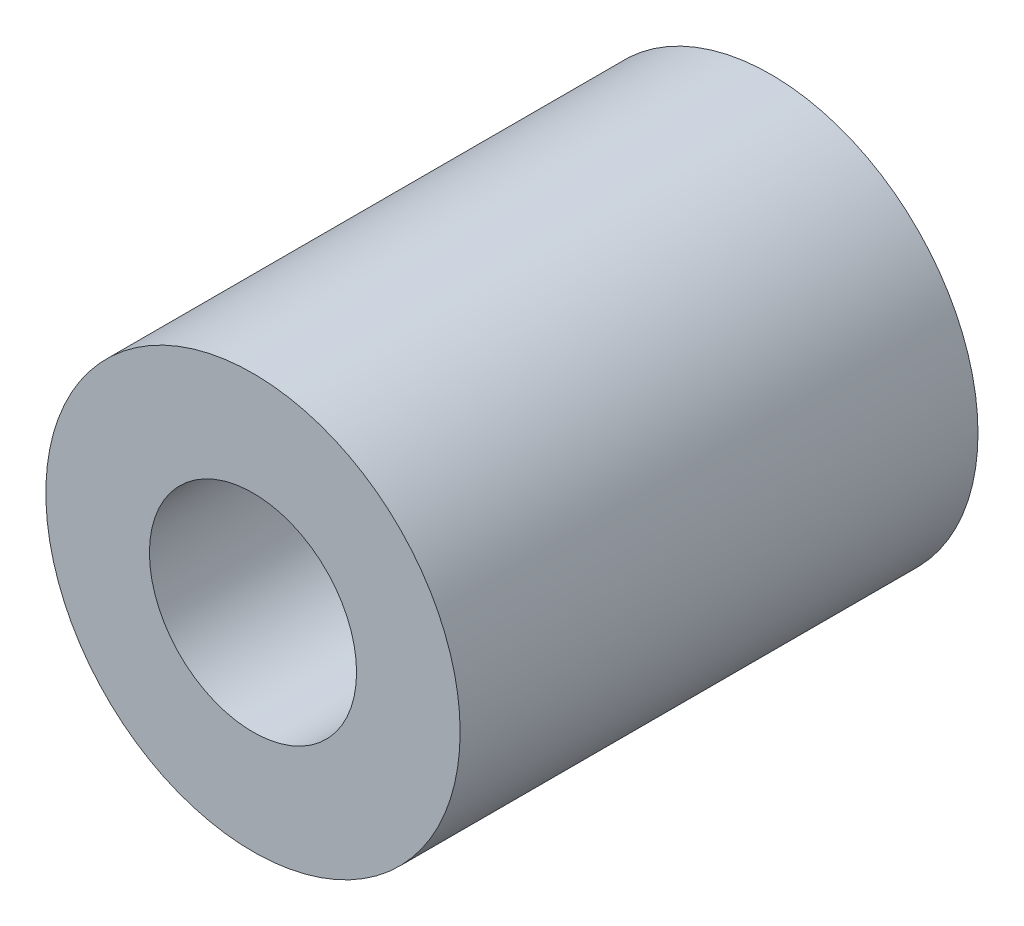
ISO-10303-21;
HEADER;
FILE_DESCRIPTION(('STEP AP214'),'2;1');
FILE_NAME('part.step','',(''),(''),'','','');
FILE_SCHEMA(('AUTOMOTIVE_DESIGN { 1 0 10303 214 1 1 1 1 }'));
ENDSEC;
DATA;
#1=APPLICATION_CONTEXT('core data for automotive mechanical design processes');
#2=APPLICATION_PROTOCOL_DEFINITION('international standard','automotive_design',2000,#1);
#3=PRODUCT_CONTEXT('',#1,'mechanical');
#4=PRODUCT('Part','Part','',(#3));
#5=PRODUCT_RELATED_PRODUCT_CATEGORY('part','',(#4));
#6=PRODUCT_DEFINITION_FORMATION('','',#4);
#7=PRODUCT_DEFINITION_CONTEXT('part definition',#1,'design');
#8=PRODUCT_DEFINITION('design','',#6,#7);
#9=PRODUCT_DEFINITION_SHAPE('','',#8);
#10=(LENGTH_UNIT() NAMED_UNIT(*) SI_UNIT(.MILLI.,.METRE.));
#11=(NAMED_UNIT(*) PLANE_ANGLE_UNIT() SI_UNIT($,.RADIAN.));
#12=(NAMED_UNIT(*) SI_UNIT($,.STERADIAN.) SOLID_ANGLE_UNIT());
#13=UNCERTAINTY_MEASURE_WITH_UNIT(LENGTH_MEASURE(1.E-05),#10,'distance_accuracy_value','');
#14=(GEOMETRIC_REPRESENTATION_CONTEXT(3) GLOBAL_UNCERTAINTY_ASSIGNED_CONTEXT((#13)) GLOBAL_UNIT_ASSIGNED_CONTEXT((#10,
#11,#12)) REPRESENTATION_CONTEXT('',''));
#15=CARTESIAN_POINT('',(0.,0.,0.));
#16=DIRECTION('',(0.,0.,1.));
#17=DIRECTION('',(1.,0.,0.));
#18=AXIS2_PLACEMENT_3D('',#15,#16,#17);
#19=CARTESIAN_POINT('',(0.,0.,5.));
#20=DIRECTION('',(0.,0.,1.));
#21=DIRECTION('',(1.,0.,0.));
#22=AXIS2_PLACEMENT_3D('',#19,#20,#21);
#23=PLANE('',#22);
#24=CARTESIAN_POINT('',(0.,0.,5.));
#25=DIRECTION('',(0.,0.,1.));
#26=DIRECTION('',(1.,0.,0.));
#27=AXIS2_PLACEMENT_3D('',#24,#25,#26);
#28=CIRCLE('',#27,2.);
#29=CARTESIAN_POINT('',(2.,0.,5.));
#30=VERTEX_POINT('',#29);
#31=EDGE_CURVE('E10',#30,#30,#28,.T.);
#32=ORIENTED_EDGE('',*,*,#31,.T.);
#33=EDGE_LOOP('',(#32));
#34=FACE_BOUND('',#33,.T.);
#35=CARTESIAN_POINT('',(0.,0.,5.));
#36=DIRECTION('',(0.,0.,1.));
#37=DIRECTION('',(1.,0.,0.));
#38=AXIS2_PLACEMENT_3D('',#35,#36,#37);
#39=CIRCLE('',#38,1.);
#40=CARTESIAN_POINT('',(1.,0.,5.));
#41=VERTEX_POINT('',#40);
#42=EDGE_CURVE('E56',#41,#41,#39,.T.);
#43=ORIENTED_EDGE('',*,*,#42,.F.);
#44=EDGE_LOOP('',(#43));
#45=FACE_BOUND('',#44,.T.);
#46=ADVANCED_FACE('F43',(#34,#45),#23,.T.);
#47=CARTESIAN_POINT('',(0.,0.,0.));
#48=DIRECTION('',(0.,0.,1.));
#49=DIRECTION('',(1.,0.,0.));
#50=AXIS2_PLACEMENT_3D('',#47,#48,#49);
#51=PLANE('',#50);
#52=CARTESIAN_POINT('',(0.,0.,0.));
#53=DIRECTION('',(0.,0.,1.));
#54=DIRECTION('',(1.,0.,0.));
#55=AXIS2_PLACEMENT_3D('',#52,#53,#54);
#56=CIRCLE('',#55,2.);
#57=CARTESIAN_POINT('',(2.,0.,0.));
#58=VERTEX_POINT('',#57);
#59=EDGE_CURVE('E47',#58,#58,#56,.T.);
#60=ORIENTED_EDGE('',*,*,#59,.F.);
#61=EDGE_LOOP('',(#60));
#62=FACE_BOUND('',#61,.T.);
#63=CARTESIAN_POINT('',(0.,0.,0.));
#64=DIRECTION('',(0.,0.,1.));
#65=DIRECTION('',(1.,0.,0.));
#66=AXIS2_PLACEMENT_3D('',#63,#64,#65);
#67=CIRCLE('',#66,1.);
#68=CARTESIAN_POINT('',(1.,0.,0.));
#69=VERTEX_POINT('',#68);
#70=EDGE_CURVE('E58',#69,#69,#67,.T.);
#71=ORIENTED_EDGE('',*,*,#70,.T.);
#72=EDGE_LOOP('',(#71));
#73=FACE_BOUND('',#72,.T.);
#74=ADVANCED_FACE('F70',(#62,#73),#51,.F.);
#75=CARTESIAN_POINT('',(0.,0.,5.));
#76=DIRECTION('',(0.,0.,-1.));
#77=DIRECTION('',(-1.,0.,0.));
#78=AXIS2_PLACEMENT_3D('',#75,#76,#77);
#79=CYLINDRICAL_SURFACE('',#78,2.);
#80=ORIENTED_EDGE('',*,*,#31,.F.);
#81=EDGE_LOOP('',(#80));
#82=FACE_BOUND('',#81,.T.);
#83=ORIENTED_EDGE('',*,*,#59,.T.);
#84=EDGE_LOOP('',(#83));
#85=FACE_BOUND('',#84,.T.);
#86=ADVANCED_FACE('F45',(#82,#85),#79,.T.);
#87=CARTESIAN_POINT('',(0.,0.,5.));
#88=DIRECTION('',(0.,0.,-1.));
#89=DIRECTION('',(-1.,0.,0.));
#90=AXIS2_PLACEMENT_3D('',#87,#88,#89);
#91=CYLINDRICAL_SURFACE('',#90,1.);
#92=ORIENTED_EDGE('',*,*,#42,.T.);
#93=EDGE_LOOP('',(#92));
#94=FACE_BOUND('',#93,.T.);
#95=ORIENTED_EDGE('',*,*,#70,.F.);
#96=EDGE_LOOP('',(#95));
#97=FACE_BOUND('',#96,.T.);
#98=ADVANCED_FACE('F66',(#94,#97),#91,.F.);
#99=CLOSED_SHELL('',(#46,#74,#86,#98));
#100=MANIFOLD_SOLID_BREP('B2',#99);
#101=ADVANCED_BREP_SHAPE_REPRESENTATION('',(#18,#100),#14);
#102=SHAPE_DEFINITION_REPRESENTATION(#9,#101);
ENDSEC;
END-ISO-10303-21;
